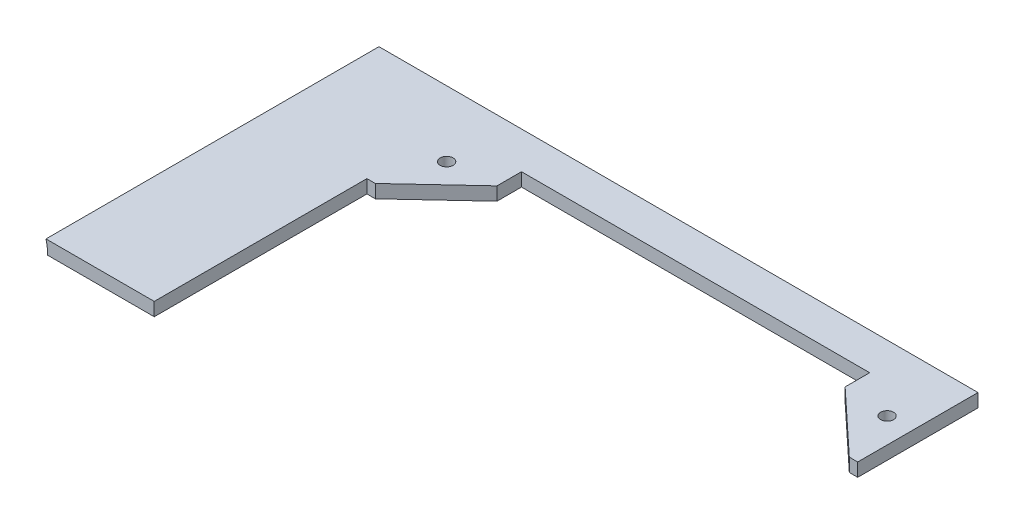
ISO-10303-21;
HEADER;
FILE_DESCRIPTION(('STEP AP214'),'2;1');
FILE_NAME('part.step','',(''),(''),'','','');
FILE_SCHEMA(('AUTOMOTIVE_DESIGN { 1 0 10303 214 1 1 1 1 }'));
ENDSEC;
DATA;
#1=APPLICATION_CONTEXT('core data for automotive mechanical design processes');
#2=APPLICATION_PROTOCOL_DEFINITION('international standard','automotive_design',2000,#1);
#3=PRODUCT_CONTEXT('',#1,'mechanical');
#4=PRODUCT('Part','Part','',(#3));
#5=PRODUCT_RELATED_PRODUCT_CATEGORY('part','',(#4));
#6=PRODUCT_DEFINITION_FORMATION('','',#4);
#7=PRODUCT_DEFINITION_CONTEXT('part definition',#1,'design');
#8=PRODUCT_DEFINITION('design','',#6,#7);
#9=PRODUCT_DEFINITION_SHAPE('','',#8);
#10=(LENGTH_UNIT() NAMED_UNIT(*) SI_UNIT(.MILLI.,.METRE.));
#11=(NAMED_UNIT(*) PLANE_ANGLE_UNIT() SI_UNIT($,.RADIAN.));
#12=(NAMED_UNIT(*) SI_UNIT($,.STERADIAN.) SOLID_ANGLE_UNIT());
#13=UNCERTAINTY_MEASURE_WITH_UNIT(LENGTH_MEASURE(1.E-05),#10,'distance_accuracy_value','');
#14=(GEOMETRIC_REPRESENTATION_CONTEXT(3) GLOBAL_UNCERTAINTY_ASSIGNED_CONTEXT((#13)) GLOBAL_UNIT_ASSIGNED_CONTEXT((#10,
#11,#12)) REPRESENTATION_CONTEXT('',''));
#15=CARTESIAN_POINT('',(0.,0.,0.));
#16=DIRECTION('',(0.,0.,1.));
#17=DIRECTION('',(1.,0.,0.));
#18=AXIS2_PLACEMENT_3D('',#15,#16,#17);
#19=CARTESIAN_POINT('',(0.,3.175,0.));
#20=DIRECTION('',(0.,-1.,0.));
#21=DIRECTION('',(0.,0.,-1.));
#22=AXIS2_PLACEMENT_3D('',#19,#20,#21);
#23=PLANE('',#22);
#24=CARTESIAN_POINT('',(52.5,3.175,-25.6052455158499));
#25=DIRECTION('',(0.,1.,0.));
#26=DIRECTION('',(0.,0.,1.));
#27=AXIS2_PLACEMENT_3D('',#24,#25,#26);
#28=CIRCLE('',#27,1.54533666301138);
#29=CARTESIAN_POINT('',(52.5,3.175,-24.0599088528386));
#30=VERTEX_POINT('',#29);
#31=EDGE_CURVE('E272',#30,#30,#28,.T.);
#32=ORIENTED_EDGE('',*,*,#31,.F.);
#33=EDGE_LOOP('',(#32));
#34=FACE_BOUND('',#33,.T.);
#35=CARTESIAN_POINT('',(-52.5052455158112,3.175,-25.6052455158499));
#36=DIRECTION('',(0.,1.,0.));
#37=DIRECTION('',(0.,0.,1.));
#38=AXIS2_PLACEMENT_3D('',#35,#36,#37);
#39=CIRCLE('',#38,1.54533666301149);
#40=CARTESIAN_POINT('',(-52.5052455158112,3.175,-24.0599088528384));
#41=VERTEX_POINT('',#40);
#42=EDGE_CURVE('E278',#41,#41,#39,.T.);
#43=ORIENTED_EDGE('',*,*,#42,.F.);
#44=EDGE_LOOP('',(#43));
#45=FACE_BOUND('',#44,.T.);
#46=DIRECTION('',(1.,0.,0.));
#47=VECTOR('',#46,1.);
#48=CARTESIAN_POINT('',(-95.25,3.175,-41.275));
#49=LINE('',#48,#47);
#50=CARTESIAN_POINT('',(-84.3032778757913,3.175,-41.275));
#51=VERTEX_POINT('',#50);
#52=CARTESIAN_POINT('',(58.5000000000001,3.175,-41.275));
#53=VERTEX_POINT('',#52);
#54=EDGE_CURVE('E274',#51,#53,#49,.T.);
#55=ORIENTED_EDGE('',*,*,#54,.F.);
#56=DIRECTION('',(0.,0.,1.));
#57=VECTOR('',#56,1.);
#58=CARTESIAN_POINT('',(-84.3032778757913,3.175,-54.08391263662));
#59=LINE('',#58,#57);
#60=CARTESIAN_POINT('',(-84.3032778757913,3.17499999999993,38.1));
#61=VERTEX_POINT('',#60);
#62=EDGE_CURVE('E178',#51,#61,#59,.T.);
#63=ORIENTED_EDGE('',*,*,#62,.T.);
#64=DIRECTION('',(1.,0.,0.));
#65=VECTOR('',#64,1.);
#66=CARTESIAN_POINT('',(-95.25,3.175,38.1));
#67=LINE('',#66,#65);
#68=CARTESIAN_POINT('',(-58.4999999999998,3.175,38.1));
#69=VERTEX_POINT('',#68);
#70=EDGE_CURVE('E172',#61,#69,#67,.T.);
#71=ORIENTED_EDGE('',*,*,#70,.T.);
#72=DIRECTION('',(0.,0.,1.));
#73=VECTOR('',#72,1.);
#74=CARTESIAN_POINT('',(-58.4999999999998,3.175,0.));
#75=LINE('',#74,#73);
#76=CARTESIAN_POINT('',(-58.4999999999999,3.175,-12.6000000000355));
#77=VERTEX_POINT('',#76);
#78=EDGE_CURVE('E310',#77,#69,#75,.T.);
#79=ORIENTED_EDGE('',*,*,#78,.F.);
#80=DIRECTION('',(-1.,0.,0.));
#81=VECTOR('',#80,1.);
#82=CARTESIAN_POINT('',(3.27862736960503E-13,3.175,-12.600000000034));
#83=LINE('',#82,#81);
#84=CARTESIAN_POINT('',(-56.4999999999999,3.175,-12.6000000000355));
#85=VERTEX_POINT('',#84);
#86=EDGE_CURVE('E281',#85,#77,#83,.T.);
#87=ORIENTED_EDGE('',*,*,#86,.F.);
#88=DIRECTION('',(0.731055268242868,0.,-0.682318250360012));
#89=VECTOR('',#88,1.);
#90=CARTESIAN_POINT('',(-32.589073634222,3.175,-34.9168646080949));
#91=LINE('',#90,#89);
#92=CARTESIAN_POINT('',(-41.4999999999999,3.175,-26.6000000000355));
#93=VERTEX_POINT('',#92);
#94=EDGE_CURVE('E291',#85,#93,#91,.T.);
#95=ORIENTED_EDGE('',*,*,#94,.T.);
#96=DIRECTION('',(0.,0.,-1.));
#97=VECTOR('',#96,1.);
#98=CARTESIAN_POINT('',(-41.4999999999999,3.175,0.));
#99=LINE('',#98,#97);
#100=CARTESIAN_POINT('',(-41.4999999999999,3.175,-32.4500000000355));
#101=VERTEX_POINT('',#100);
#102=EDGE_CURVE('E328',#93,#101,#99,.T.);
#103=ORIENTED_EDGE('',*,*,#102,.T.);
#104=DIRECTION('',(1.,0.,0.));
#105=VECTOR('',#104,1.);
#106=CARTESIAN_POINT('',(0.,3.175,-32.4500000000355));
#107=LINE('',#106,#105);
#108=CARTESIAN_POINT('',(41.5000000000001,3.175,-32.4500000000355));
#109=VERTEX_POINT('',#108);
#110=EDGE_CURVE('E325',#101,#109,#107,.T.);
#111=ORIENTED_EDGE('',*,*,#110,.T.);
#112=DIRECTION('',(0.,0.,1.));
#113=VECTOR('',#112,1.);
#114=CARTESIAN_POINT('',(41.5000000000001,3.175,0.));
#115=LINE('',#114,#113);
#116=CARTESIAN_POINT('',(41.5000000000001,3.175,-26.6000000000355));
#117=VERTEX_POINT('',#116);
#118=EDGE_CURVE('E322',#109,#117,#115,.T.);
#119=ORIENTED_EDGE('',*,*,#118,.T.);
#120=DIRECTION('',(0.731055268242869,0.,0.682318250360011));
#121=VECTOR('',#120,1.);
#122=CARTESIAN_POINT('',(32.589073634222,3.175,-34.916864608095));
#123=LINE('',#122,#121);
#124=CARTESIAN_POINT('',(56.5000000000001,3.175,-12.6000000000355));
#125=VERTEX_POINT('',#124);
#126=EDGE_CURVE('E319',#117,#125,#123,.T.);
#127=ORIENTED_EDGE('',*,*,#126,.T.);
#128=DIRECTION('',(1.,0.,0.));
#129=VECTOR('',#128,1.);
#130=CARTESIAN_POINT('',(0.,3.175,-12.6000000000355));
#131=LINE('',#130,#129);
#132=CARTESIAN_POINT('',(58.5000000000001,3.175,-12.6000000000355));
#133=VERTEX_POINT('',#132);
#134=EDGE_CURVE('E316',#125,#133,#131,.T.);
#135=ORIENTED_EDGE('',*,*,#134,.T.);
#136=DIRECTION('',(0.,0.,-1.));
#137=VECTOR('',#136,1.);
#138=CARTESIAN_POINT('',(58.5000000000001,3.175,0.));
#139=LINE('',#138,#137);
#140=EDGE_CURVE('E313',#133,#53,#139,.T.);
#141=ORIENTED_EDGE('',*,*,#140,.T.);
#142=EDGE_LOOP('',(#55,#63,#71,#79,#87,#95,#103,#111,#119,#127,#135,#141));
#143=FACE_BOUND('',#142,.T.);
#144=ADVANCED_FACE('F164',(#34,#45,#143),#23,.F.);
#145=CARTESIAN_POINT('',(0.,0.,0.));
#146=DIRECTION('',(0.,-1.,0.));
#147=DIRECTION('',(0.,0.,-1.));
#148=AXIS2_PLACEMENT_3D('',#145,#146,#147);
#149=PLANE('',#148);
#150=DIRECTION('',(0.,0.,1.));
#151=VECTOR('',#150,1.);
#152=CARTESIAN_POINT('',(-83.8999999999999,0.,-54.08391263662));
#153=LINE('',#152,#151);
#154=CARTESIAN_POINT('',(-83.8999999999999,0.,-41.275));
#155=VERTEX_POINT('',#154);
#156=CARTESIAN_POINT('',(-83.8999999999999,0.,38.1));
#157=VERTEX_POINT('',#156);
#158=EDGE_CURVE('E253',#155,#157,#153,.T.);
#159=ORIENTED_EDGE('',*,*,#158,.F.);
#160=DIRECTION('',(-1.,0.,0.));
#161=VECTOR('',#160,1.);
#162=CARTESIAN_POINT('',(58.5000000000001,0.,-41.275));
#163=LINE('',#162,#161);
#164=CARTESIAN_POINT('',(58.5000000000001,0.,-41.275));
#165=VERTEX_POINT('',#164);
#166=EDGE_CURVE('E262',#165,#155,#163,.T.);
#167=ORIENTED_EDGE('',*,*,#166,.F.);
#168=DIRECTION('',(0.,0.,-1.));
#169=VECTOR('',#168,1.);
#170=CARTESIAN_POINT('',(58.5000000000001,0.,0.));
#171=LINE('',#170,#169);
#172=CARTESIAN_POINT('',(58.5000000000001,0.,-12.6000000000355));
#173=VERTEX_POINT('',#172);
#174=EDGE_CURVE('E293',#173,#165,#171,.T.);
#175=ORIENTED_EDGE('',*,*,#174,.F.);
#176=DIRECTION('',(1.,0.,0.));
#177=VECTOR('',#176,1.);
#178=CARTESIAN_POINT('',(0.,0.,-12.6000000000355));
#179=LINE('',#178,#177);
#180=CARTESIAN_POINT('',(56.5000000000001,0.,-12.6000000000355));
#181=VERTEX_POINT('',#180);
#182=EDGE_CURVE('E295',#181,#173,#179,.T.);
#183=ORIENTED_EDGE('',*,*,#182,.F.);
#184=DIRECTION('',(0.731055268242869,0.,0.682318250360011));
#185=VECTOR('',#184,1.);
#186=CARTESIAN_POINT('',(32.589073634222,0.,-34.916864608095));
#187=LINE('',#186,#185);
#188=CARTESIAN_POINT('',(41.5000000000001,0.,-26.6000000000355));
#189=VERTEX_POINT('',#188);
#190=EDGE_CURVE('E297',#189,#181,#187,.T.);
#191=ORIENTED_EDGE('',*,*,#190,.F.);
#192=DIRECTION('',(0.,0.,1.));
#193=VECTOR('',#192,1.);
#194=CARTESIAN_POINT('',(41.5000000000001,0.,0.));
#195=LINE('',#194,#193);
#196=CARTESIAN_POINT('',(41.5000000000001,0.,-32.4500000000355));
#197=VERTEX_POINT('',#196);
#198=EDGE_CURVE('E299',#197,#189,#195,.T.);
#199=ORIENTED_EDGE('',*,*,#198,.F.);
#200=DIRECTION('',(1.,0.,0.));
#201=VECTOR('',#200,1.);
#202=CARTESIAN_POINT('',(0.,0.,-32.4500000000355));
#203=LINE('',#202,#201);
#204=CARTESIAN_POINT('',(-41.4999999999999,0.,-32.4500000000355));
#205=VERTEX_POINT('',#204);
#206=EDGE_CURVE('E301',#205,#197,#203,.T.);
#207=ORIENTED_EDGE('',*,*,#206,.F.);
#208=DIRECTION('',(0.,0.,-1.));
#209=VECTOR('',#208,1.);
#210=CARTESIAN_POINT('',(-41.4999999999999,0.,0.));
#211=LINE('',#210,#209);
#212=CARTESIAN_POINT('',(-41.4999999999999,0.,-26.6000000000355));
#213=VERTEX_POINT('',#212);
#214=EDGE_CURVE('E303',#213,#205,#211,.T.);
#215=ORIENTED_EDGE('',*,*,#214,.F.);
#216=DIRECTION('',(0.731055268242868,0.,-0.682318250360012));
#217=VECTOR('',#216,1.);
#218=CARTESIAN_POINT('',(-32.589073634222,0.,-34.9168646080949));
#219=LINE('',#218,#217);
#220=CARTESIAN_POINT('',(-56.4999999999999,0.,-12.6000000000355));
#221=VERTEX_POINT('',#220);
#222=EDGE_CURVE('E305',#221,#213,#219,.T.);
#223=ORIENTED_EDGE('',*,*,#222,.F.);
#224=DIRECTION('',(-1.,0.,0.));
#225=VECTOR('',#224,1.);
#226=CARTESIAN_POINT('',(3.27862736960503E-13,0.,-12.600000000034));
#227=LINE('',#226,#225);
#228=CARTESIAN_POINT('',(-58.4999999999999,0.,-12.6000000000355));
#229=VERTEX_POINT('',#228);
#230=EDGE_CURVE('E287',#221,#229,#227,.T.);
#231=ORIENTED_EDGE('',*,*,#230,.T.);
#232=DIRECTION('',(0.,0.,1.));
#233=VECTOR('',#232,1.);
#234=CARTESIAN_POINT('',(-58.4999999999998,0.,0.));
#235=LINE('',#234,#233);
#236=CARTESIAN_POINT('',(-58.4999999999998,0.,38.1));
#237=VERTEX_POINT('',#236);
#238=EDGE_CURVE('E290',#229,#237,#235,.T.);
#239=ORIENTED_EDGE('',*,*,#238,.T.);
#240=DIRECTION('',(1.,0.,0.));
#241=VECTOR('',#240,1.);
#242=CARTESIAN_POINT('',(-95.25,0.,38.1));
#243=LINE('',#242,#241);
#244=EDGE_CURVE('E186',#157,#237,#243,.T.);
#245=ORIENTED_EDGE('',*,*,#244,.F.);
#246=EDGE_LOOP('',(#159,#167,#175,#183,#191,#199,#207,#215,#223,#231,#239,#245));
#247=FACE_BOUND('',#246,.T.);
#248=CARTESIAN_POINT('',(52.5,0.,-25.6052455158499));
#249=DIRECTION('',(0.,1.,0.));
#250=DIRECTION('',(0.,0.,1.));
#251=AXIS2_PLACEMENT_3D('',#248,#249,#250);
#252=CIRCLE('',#251,1.54533666301138);
#253=CARTESIAN_POINT('',(52.5,0.,-24.0599088528386));
#254=VERTEX_POINT('',#253);
#255=EDGE_CURVE('E269',#254,#254,#252,.T.);
#256=ORIENTED_EDGE('',*,*,#255,.T.);
#257=EDGE_LOOP('',(#256));
#258=FACE_BOUND('',#257,.T.);
#259=CARTESIAN_POINT('',(-52.5052455158112,0.,-25.6052455158499));
#260=DIRECTION('',(0.,1.,0.));
#261=DIRECTION('',(0.,0.,1.));
#262=AXIS2_PLACEMENT_3D('',#259,#260,#261);
#263=CIRCLE('',#262,1.54533666301149);
#264=CARTESIAN_POINT('',(-52.5052455158112,0.,-24.0599088528384));
#265=VERTEX_POINT('',#264);
#266=EDGE_CURVE('E282',#265,#265,#263,.T.);
#267=ORIENTED_EDGE('',*,*,#266,.T.);
#268=EDGE_LOOP('',(#267));
#269=FACE_BOUND('',#268,.T.);
#270=ADVANCED_FACE('F259',(#247,#258,#269),#149,.T.);
#271=CARTESIAN_POINT('',(-95.25,3.175,38.1));
#272=DIRECTION('',(0.,0.,-1.));
#273=DIRECTION('',(-1.,0.,0.));
#274=AXIS2_PLACEMENT_3D('',#271,#272,#273);
#275=PLANE('',#274);
#276=ORIENTED_EDGE('',*,*,#70,.F.);
#277=CARTESIAN_POINT('',(-96.5999999999999,0.,38.1));
#278=DIRECTION('',(0.,0.,-1.));
#279=DIRECTION('',(-1.,0.,0.));
#280=AXIS2_PLACEMENT_3D('',#277,#278,#279);
#281=CIRCLE('',#280,12.7);
#282=EDGE_CURVE('E544',#61,#157,#281,.T.);
#283=ORIENTED_EDGE('',*,*,#282,.T.);
#284=ORIENTED_EDGE('',*,*,#244,.T.);
#285=DIRECTION('',(0.,1.,0.));
#286=VECTOR('',#285,1.);
#287=CARTESIAN_POINT('',(-58.4999999999998,0.,38.1));
#288=LINE('',#287,#286);
#289=EDGE_CURVE('E347',#237,#69,#288,.T.);
#290=ORIENTED_EDGE('',*,*,#289,.T.);
#291=EDGE_LOOP('',(#276,#283,#284,#290));
#292=FACE_BOUND('',#291,.T.);
#293=ADVANCED_FACE('F166',(#292),#275,.F.);
#294=CARTESIAN_POINT('',(3.27862736960503E-13,0.,-12.600000000034));
#295=DIRECTION('',(0.,0.,-1.));
#296=DIRECTION('',(-1.,0.,0.));
#297=AXIS2_PLACEMENT_3D('',#294,#295,#296);
#298=PLANE('',#297);
#299=ORIENTED_EDGE('',*,*,#86,.T.);
#300=DIRECTION('',(0.,1.,0.));
#301=VECTOR('',#300,1.);
#302=CARTESIAN_POINT('',(-58.4999999999999,0.,-12.6000000000355));
#303=LINE('',#302,#301);
#304=EDGE_CURVE('E307',#229,#77,#303,.T.);
#305=ORIENTED_EDGE('',*,*,#304,.F.);
#306=ORIENTED_EDGE('',*,*,#230,.F.);
#307=DIRECTION('',(0.,1.,0.));
#308=VECTOR('',#307,1.);
#309=CARTESIAN_POINT('',(-56.4999999999999,0.,-12.6000000000355));
#310=LINE('',#309,#308);
#311=EDGE_CURVE('E333',#221,#85,#310,.T.);
#312=ORIENTED_EDGE('',*,*,#311,.T.);
#313=EDGE_LOOP('',(#299,#305,#306,#312));
#314=FACE_BOUND('',#313,.T.);
#315=ADVANCED_FACE('F358',(#314),#298,.F.);
#316=CARTESIAN_POINT('',(-32.589073634222,0.,-34.9168646080949));
#317=DIRECTION('',(0.682318250360012,0.,0.731055268242868));
#318=DIRECTION('',(0.731055268242869,0.,-0.682318250360012));
#319=AXIS2_PLACEMENT_3D('',#316,#317,#318);
#320=PLANE('',#319);
#321=ORIENTED_EDGE('',*,*,#94,.F.);
#322=ORIENTED_EDGE('',*,*,#311,.F.);
#323=ORIENTED_EDGE('',*,*,#222,.T.);
#324=DIRECTION('',(0.,1.,0.));
#325=VECTOR('',#324,1.);
#326=CARTESIAN_POINT('',(-41.4999999999999,0.,-26.6000000000355));
#327=LINE('',#326,#325);
#328=EDGE_CURVE('E335',#213,#93,#327,.T.);
#329=ORIENTED_EDGE('',*,*,#328,.T.);
#330=EDGE_LOOP('',(#321,#322,#323,#329));
#331=FACE_BOUND('',#330,.T.);
#332=ADVANCED_FACE('F363',(#331),#320,.T.);
#333=CARTESIAN_POINT('',(-41.4999999999999,0.,0.));
#334=DIRECTION('',(1.,0.,0.));
#335=DIRECTION('',(0.,0.,-1.));
#336=AXIS2_PLACEMENT_3D('',#333,#334,#335);
#337=PLANE('',#336);
#338=ORIENTED_EDGE('',*,*,#102,.F.);
#339=ORIENTED_EDGE('',*,*,#328,.F.);
#340=ORIENTED_EDGE('',*,*,#214,.T.);
#341=DIRECTION('',(0.,1.,0.));
#342=VECTOR('',#341,1.);
#343=CARTESIAN_POINT('',(-41.4999999999999,0.,-32.4500000000355));
#344=LINE('',#343,#342);
#345=EDGE_CURVE('E337',#205,#101,#344,.T.);
#346=ORIENTED_EDGE('',*,*,#345,.T.);
#347=EDGE_LOOP('',(#338,#339,#340,#346));
#348=FACE_BOUND('',#347,.T.);
#349=ADVANCED_FACE('F396',(#348),#337,.T.);
#350=CARTESIAN_POINT('',(0.,0.,-32.4500000000355));
#351=DIRECTION('',(0.,0.,1.));
#352=DIRECTION('',(1.,0.,0.));
#353=AXIS2_PLACEMENT_3D('',#350,#351,#352);
#354=PLANE('',#353);
#355=ORIENTED_EDGE('',*,*,#110,.F.);
#356=ORIENTED_EDGE('',*,*,#345,.F.);
#357=ORIENTED_EDGE('',*,*,#206,.T.);
#358=DIRECTION('',(0.,1.,0.));
#359=VECTOR('',#358,1.);
#360=CARTESIAN_POINT('',(41.5000000000001,0.,-32.4500000000355));
#361=LINE('',#360,#359);
#362=EDGE_CURVE('E339',#197,#109,#361,.T.);
#363=ORIENTED_EDGE('',*,*,#362,.T.);
#364=EDGE_LOOP('',(#355,#356,#357,#363));
#365=FACE_BOUND('',#364,.T.);
#366=ADVANCED_FACE('F392',(#365),#354,.T.);
#367=CARTESIAN_POINT('',(41.5000000000001,0.,0.));
#368=DIRECTION('',(-1.,0.,0.));
#369=DIRECTION('',(0.,0.,1.));
#370=AXIS2_PLACEMENT_3D('',#367,#368,#369);
#371=PLANE('',#370);
#372=ORIENTED_EDGE('',*,*,#118,.F.);
#373=ORIENTED_EDGE('',*,*,#362,.F.);
#374=ORIENTED_EDGE('',*,*,#198,.T.);
#375=DIRECTION('',(0.,1.,0.));
#376=VECTOR('',#375,1.);
#377=CARTESIAN_POINT('',(41.5000000000001,0.,-26.6000000000355));
#378=LINE('',#377,#376);
#379=EDGE_CURVE('E341',#189,#117,#378,.T.);
#380=ORIENTED_EDGE('',*,*,#379,.T.);
#381=EDGE_LOOP('',(#372,#373,#374,#380));
#382=FACE_BOUND('',#381,.T.);
#383=ADVANCED_FACE('F388',(#382),#371,.T.);
#384=CARTESIAN_POINT('',(32.589073634222,0.,-34.916864608095));
#385=DIRECTION('',(-0.682318250360011,0.,0.731055268242869));
#386=DIRECTION('',(0.731055268242869,0.,0.682318250360011));
#387=AXIS2_PLACEMENT_3D('',#384,#385,#386);
#388=PLANE('',#387);
#389=ORIENTED_EDGE('',*,*,#126,.F.);
#390=ORIENTED_EDGE('',*,*,#379,.F.);
#391=ORIENTED_EDGE('',*,*,#190,.T.);
#392=DIRECTION('',(0.,1.,0.));
#393=VECTOR('',#392,1.);
#394=CARTESIAN_POINT('',(56.5000000000001,0.,-12.6000000000355));
#395=LINE('',#394,#393);
#396=EDGE_CURVE('E343',#181,#125,#395,.T.);
#397=ORIENTED_EDGE('',*,*,#396,.T.);
#398=EDGE_LOOP('',(#389,#390,#391,#397));
#399=FACE_BOUND('',#398,.T.);
#400=ADVANCED_FACE('F384',(#399),#388,.T.);
#401=CARTESIAN_POINT('',(0.,0.,-12.6000000000355));
#402=DIRECTION('',(0.,0.,1.));
#403=DIRECTION('',(1.,0.,0.));
#404=AXIS2_PLACEMENT_3D('',#401,#402,#403);
#405=PLANE('',#404);
#406=ORIENTED_EDGE('',*,*,#134,.F.);
#407=ORIENTED_EDGE('',*,*,#396,.F.);
#408=ORIENTED_EDGE('',*,*,#182,.T.);
#409=DIRECTION('',(0.,1.,0.));
#410=VECTOR('',#409,1.);
#411=CARTESIAN_POINT('',(58.5000000000001,0.,-12.6000000000355));
#412=LINE('',#411,#410);
#413=EDGE_CURVE('E345',#173,#133,#412,.T.);
#414=ORIENTED_EDGE('',*,*,#413,.T.);
#415=EDGE_LOOP('',(#406,#407,#408,#414));
#416=FACE_BOUND('',#415,.T.);
#417=ADVANCED_FACE('F380',(#416),#405,.T.);
#418=CARTESIAN_POINT('',(58.5000000000001,0.,0.));
#419=DIRECTION('',(1.,0.,0.));
#420=DIRECTION('',(0.,0.,-1.));
#421=AXIS2_PLACEMENT_3D('',#418,#419,#420);
#422=PLANE('',#421);
#423=ORIENTED_EDGE('',*,*,#140,.F.);
#424=ORIENTED_EDGE('',*,*,#413,.F.);
#425=ORIENTED_EDGE('',*,*,#174,.T.);
#426=DIRECTION('',(0.,-1.,0.));
#427=VECTOR('',#426,1.);
#428=CARTESIAN_POINT('',(58.5000000000001,3.175,-41.275));
#429=LINE('',#428,#427);
#430=EDGE_CURVE('E268',#53,#165,#429,.T.);
#431=ORIENTED_EDGE('',*,*,#430,.F.);
#432=EDGE_LOOP('',(#423,#424,#425,#431));
#433=FACE_BOUND('',#432,.T.);
#434=ADVANCED_FACE('F377',(#433),#422,.T.);
#435=CARTESIAN_POINT('',(-58.4999999999998,0.,0.));
#436=DIRECTION('',(-1.,0.,0.));
#437=DIRECTION('',(0.,0.,1.));
#438=AXIS2_PLACEMENT_3D('',#435,#436,#437);
#439=PLANE('',#438);
#440=ORIENTED_EDGE('',*,*,#78,.T.);
#441=ORIENTED_EDGE('',*,*,#289,.F.);
#442=ORIENTED_EDGE('',*,*,#238,.F.);
#443=ORIENTED_EDGE('',*,*,#304,.T.);
#444=EDGE_LOOP('',(#440,#441,#442,#443));
#445=FACE_BOUND('',#444,.T.);
#446=ADVANCED_FACE('F355',(#445),#439,.F.);
#447=CARTESIAN_POINT('',(-52.5052455158112,0.,-25.6052455158499));
#448=DIRECTION('',(0.,1.,0.));
#449=DIRECTION('',(0.,0.,1.));
#450=AXIS2_PLACEMENT_3D('',#447,#448,#449);
#451=CYLINDRICAL_SURFACE('',#450,1.54533666301149);
#452=ORIENTED_EDGE('',*,*,#266,.F.);
#453=EDGE_LOOP('',(#452));
#454=FACE_BOUND('',#453,.T.);
#455=ORIENTED_EDGE('',*,*,#42,.T.);
#456=EDGE_LOOP('',(#455));
#457=FACE_BOUND('',#456,.T.);
#458=ADVANCED_FACE('F376',(#454,#457),#451,.F.);
#459=CARTESIAN_POINT('',(52.5,0.,-25.6052455158499));
#460=DIRECTION('',(0.,1.,0.));
#461=DIRECTION('',(0.,0.,1.));
#462=AXIS2_PLACEMENT_3D('',#459,#460,#461);
#463=CYLINDRICAL_SURFACE('',#462,1.54533666301138);
#464=ORIENTED_EDGE('',*,*,#255,.F.);
#465=EDGE_LOOP('',(#464));
#466=FACE_BOUND('',#465,.T.);
#467=ORIENTED_EDGE('',*,*,#31,.T.);
#468=EDGE_LOOP('',(#467));
#469=FACE_BOUND('',#468,.T.);
#470=ADVANCED_FACE('F404',(#466,#469),#463,.F.);
#471=CARTESIAN_POINT('',(0.,0.,-41.275));
#472=DIRECTION('',(0.,0.,-1.));
#473=DIRECTION('',(-1.,0.,0.));
#474=AXIS2_PLACEMENT_3D('',#471,#472,#473);
#475=PLANE('',#474);
#476=CARTESIAN_POINT('',(-96.5999999999999,0.,-41.275));
#477=DIRECTION('',(0.,0.,-1.));
#478=DIRECTION('',(-1.,0.,0.));
#479=AXIS2_PLACEMENT_3D('',#476,#477,#478);
#480=CIRCLE('',#479,12.7);
#481=EDGE_CURVE('E12',#51,#155,#480,.T.);
#482=ORIENTED_EDGE('',*,*,#481,.F.);
#483=ORIENTED_EDGE('',*,*,#54,.T.);
#484=ORIENTED_EDGE('',*,*,#430,.T.);
#485=ORIENTED_EDGE('',*,*,#166,.T.);
#486=EDGE_LOOP('',(#482,#483,#484,#485));
#487=FACE_BOUND('',#486,.T.);
#488=ADVANCED_FACE('F266',(#487),#475,.T.);
#489=CARTESIAN_POINT('',(-96.5999999999999,0.,-54.08391263662));
#490=DIRECTION('',(0.,0.,1.));
#491=DIRECTION('',(0.,-1.,0.));
#492=AXIS2_PLACEMENT_3D('',#489,#490,#491);
#493=CYLINDRICAL_SURFACE('',#492,12.7);
#494=ORIENTED_EDGE('',*,*,#62,.F.);
#495=ORIENTED_EDGE('',*,*,#481,.T.);
#496=ORIENTED_EDGE('',*,*,#158,.T.);
#497=ORIENTED_EDGE('',*,*,#282,.F.);
#498=EDGE_LOOP('',(#494,#495,#496,#497));
#499=FACE_BOUND('',#498,.T.);
#500=ADVANCED_FACE('F252',(#499),#493,.F.);
#501=CLOSED_SHELL('',(#144,#270,#293,#315,#332,#349,#366,#383,#400,#417,#434,#446,#458,#470,
#488,#500));
#502=MANIFOLD_SOLID_BREP('B2',#501);
#503=ADVANCED_BREP_SHAPE_REPRESENTATION('',(#18,#502),#14);
#504=SHAPE_DEFINITION_REPRESENTATION(#9,#503);
ENDSEC;
END-ISO-10303-21;
